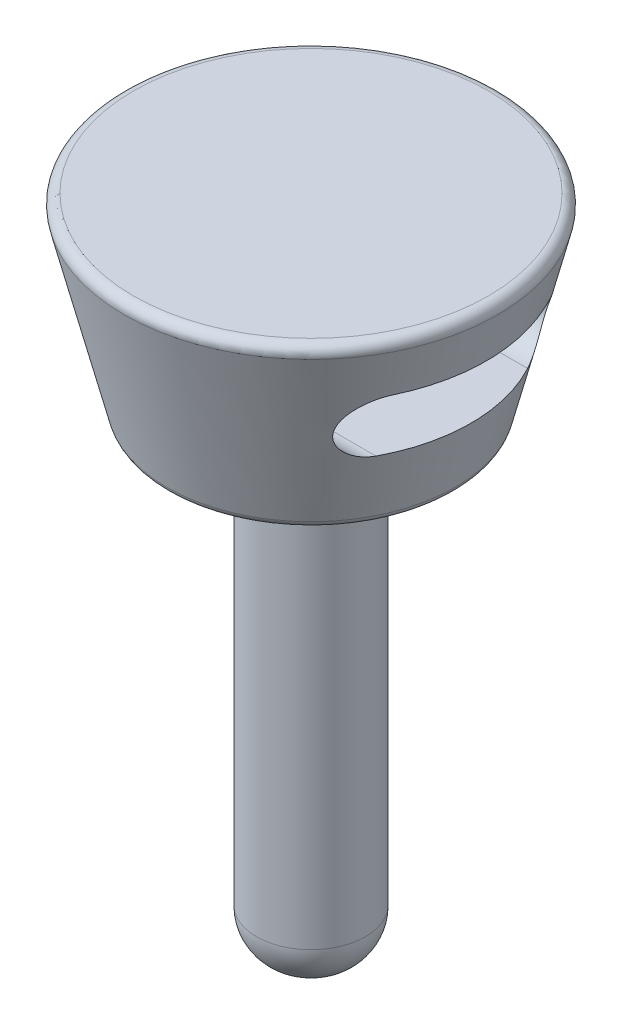
ISO-10303-21;
HEADER;
FILE_DESCRIPTION(('STEP AP214'),'2;1');
FILE_NAME('part.step','',(''),(''),'','','');
FILE_SCHEMA(('AUTOMOTIVE_DESIGN { 1 0 10303 214 1 1 1 1 }'));
ENDSEC;
DATA;
#1=APPLICATION_CONTEXT('core data for automotive mechanical design processes');
#2=APPLICATION_PROTOCOL_DEFINITION('international standard','automotive_design',2000,#1);
#3=PRODUCT_CONTEXT('',#1,'mechanical');
#4=PRODUCT('Part','Part','',(#3));
#5=PRODUCT_RELATED_PRODUCT_CATEGORY('part','',(#4));
#6=PRODUCT_DEFINITION_FORMATION('','',#4);
#7=PRODUCT_DEFINITION_CONTEXT('part definition',#1,'design');
#8=PRODUCT_DEFINITION('design','',#6,#7);
#9=PRODUCT_DEFINITION_SHAPE('','',#8);
#10=(LENGTH_UNIT() NAMED_UNIT(*) SI_UNIT(.MILLI.,.METRE.));
#11=(NAMED_UNIT(*) PLANE_ANGLE_UNIT() SI_UNIT($,.RADIAN.));
#12=(NAMED_UNIT(*) SI_UNIT($,.STERADIAN.) SOLID_ANGLE_UNIT());
#13=UNCERTAINTY_MEASURE_WITH_UNIT(LENGTH_MEASURE(1.E-05),#10,'distance_accuracy_value','');
#14=(GEOMETRIC_REPRESENTATION_CONTEXT(3) GLOBAL_UNCERTAINTY_ASSIGNED_CONTEXT((#13)) GLOBAL_UNIT_ASSIGNED_CONTEXT((#10,
#11,#12)) REPRESENTATION_CONTEXT('',''));
#15=CARTESIAN_POINT('',(0.,0.,0.));
#16=DIRECTION('',(0.,0.,1.));
#17=DIRECTION('',(1.,0.,0.));
#18=AXIS2_PLACEMENT_3D('',#15,#16,#17);
#19=CARTESIAN_POINT('',(0.,-14.,0.));
#20=DIRECTION('',(0.,-1.,0.));
#21=DIRECTION('',(0.,0.,-1.));
#22=AXIS2_PLACEMENT_3D('',#19,#20,#21);
#23=PLANE('',#22);
#24=CARTESIAN_POINT('',(0.,-14.,0.));
#25=DIRECTION('',(0.,1.,0.));
#26=DIRECTION('',(0.,0.,-1.));
#27=AXIS2_PLACEMENT_3D('',#24,#25,#26);
#28=CIRCLE('',#27,0.15);
#29=CARTESIAN_POINT('',(0.,-14.,-0.15));
#30=VERTEX_POINT('',#29);
#31=CARTESIAN_POINT('',(0.,-14.,0.15));
#32=VERTEX_POINT('',#31);
#33=EDGE_CURVE('E63',#30,#32,#28,.T.);
#34=ORIENTED_EDGE('',*,*,#33,.F.);
#35=CARTESIAN_POINT('',(0.,-14.,0.));
#36=DIRECTION('',(0.,1.,0.));
#37=DIRECTION('',(0.,0.,1.));
#38=AXIS2_PLACEMENT_3D('',#35,#36,#37);
#39=CIRCLE('',#38,0.15);
#40=EDGE_CURVE('E61',#32,#30,#39,.T.);
#41=ORIENTED_EDGE('',*,*,#40,.F.);
#42=EDGE_LOOP('',(#34,#41));
#43=FACE_BOUND('',#42,.T.);
#44=ADVANCED_FACE('F15',(#43),#23,.T.);
#45=CARTESIAN_POINT('',(0.,-13.,-0.15));
#46=DIRECTION('',(1.,0.,0.));
#47=DIRECTION('',(0.,0.,-1.));
#48=AXIS2_PLACEMENT_3D('',#45,#46,#47);
#49=CIRCLE('',#48,1.);
#50=TRIMMED_CURVE('',#49,(PARAMETER_VALUE(-1.72136459957158)),
(PARAMETER_VALUE(1.72136459957158)),.T.,.PARAMETER.);
#51=CARTESIAN_POINT('',(0.,-13.,0.));
#52=DIRECTION('',(0.,-1.,0.));
#53=AXIS1_PLACEMENT('',#51,#52);
#54=SURFACE_OF_REVOLUTION('',#50,#53);
#55=ORIENTED_EDGE('',*,*,#40,.T.);
#56=ORIENTED_EDGE('',*,*,#33,.T.);
#57=EDGE_LOOP('',(#55,#56));
#58=FACE_BOUND('',#57,.T.);
#59=CARTESIAN_POINT('',(0.,-13.,0.));
#60=DIRECTION('',(0.,1.,0.));
#61=DIRECTION('',(0.,0.,1.));
#62=AXIS2_PLACEMENT_3D('',#59,#60,#61);
#63=CIRCLE('',#62,1.15);
#64=CARTESIAN_POINT('',(0.,-13.,1.15));
#65=VERTEX_POINT('',#64);
#66=EDGE_CURVE('E69',#65,#65,#63,.T.);
#67=ORIENTED_EDGE('',*,*,#66,.F.);
#68=EDGE_LOOP('',(#67));
#69=FACE_BOUND('',#68,.T.);
#70=ADVANCED_FACE('F65',(#58,#69),#54,.F.);
#71=CARTESIAN_POINT('',(0.,-14.,0.));
#72=DIRECTION('',(0.,1.,0.));
#73=DIRECTION('',(0.,0.,1.));
#74=AXIS2_PLACEMENT_3D('',#71,#72,#73);
#75=CYLINDRICAL_SURFACE('',#74,1.15);
#76=CARTESIAN_POINT('',(0.,-4.,0.));
#77=DIRECTION('',(0.,1.,0.));
#78=DIRECTION('',(0.,0.,1.));
#79=AXIS2_PLACEMENT_3D('',#76,#77,#78);
#80=CIRCLE('',#79,1.15);
#81=CARTESIAN_POINT('',(0.,-4.,1.15));
#82=VERTEX_POINT('',#81);
#83=EDGE_CURVE('E91',#82,#82,#80,.F.);
#84=ORIENTED_EDGE('',*,*,#83,.T.);
#85=EDGE_LOOP('',(#84));
#86=FACE_BOUND('',#85,.T.);
#87=ORIENTED_EDGE('',*,*,#66,.T.);
#88=EDGE_LOOP('',(#87));
#89=FACE_BOUND('',#88,.T.);
#90=ADVANCED_FACE('F101',(#86,#89),#75,.T.);
#91=CARTESIAN_POINT('',(-3.,-4.,0.));
#92=DIRECTION('',(0.,1.,0.));
#93=DIRECTION('',(0.,0.,1.));
#94=AXIS2_PLACEMENT_3D('',#91,#92,#93);
#95=PLANE('',#94);
#96=ORIENTED_EDGE('',*,*,#83,.F.);
#97=EDGE_LOOP('',(#96));
#98=FACE_BOUND('',#97,.T.);
#99=CARTESIAN_POINT('',(0.,-4.,0.));
#100=DIRECTION('',(0.,1.,0.));
#101=DIRECTION('',(0.,0.,-1.));
#102=AXIS2_PLACEMENT_3D('',#99,#100,#101);
#103=CIRCLE('',#102,2.84384471871912);
#104=CARTESIAN_POINT('',(0.,-4.,-2.84384471871912));
#105=VERTEX_POINT('',#104);
#106=CARTESIAN_POINT('',(0.,-4.,2.84384471871912));
#107=VERTEX_POINT('',#106);
#108=EDGE_CURVE('E211',#105,#107,#103,.T.);
#109=ORIENTED_EDGE('',*,*,#108,.F.);
#110=CARTESIAN_POINT('',(0.,-4.,0.));
#111=DIRECTION('',(0.,1.,0.));
#112=DIRECTION('',(0.,0.,1.));
#113=AXIS2_PLACEMENT_3D('',#110,#111,#112);
#114=CIRCLE('',#113,2.84384471871912);
#115=EDGE_CURVE('E210',#107,#105,#114,.T.);
#116=ORIENTED_EDGE('',*,*,#115,.F.);
#117=EDGE_LOOP('',(#109,#116));
#118=FACE_BOUND('',#117,.T.);
#119=ADVANCED_FACE('F191',(#98,#118),#95,.F.);
#120=CARTESIAN_POINT('',(-4.,-1.86258614224946,-1.6));
#121=DIRECTION('',(1.,0.,0.));
#122=DIRECTION('',(0.,0.,-1.));
#123=AXIS2_PLACEMENT_3D('',#120,#121,#122);
#124=CYLINDRICAL_SURFACE('',#123,0.65);
#125=CARTESIAN_POINT('',(-2.96811669747267,-2.51258613400775,-1.59989970502933));
#126=CARTESIAN_POINT('',(-2.94656784911217,-2.51258707770298,-1.63995761628789));
#127=CARTESIAN_POINT('',(-2.92493537934197,-2.50889429176,-1.68001692264612));
#128=CARTESIAN_POINT('',(-2.88216932879334,-2.49402543937922,-1.75948598220322));
#129=CARTESIAN_POINT('',(-2.8610422841815,-2.48277988812432,-1.79888619035241));
#130=CARTESIAN_POINT('',(-2.82033350761219,-2.45266785909596,-1.87570133933229));
#131=CARTESIAN_POINT('',(-2.80075605328271,-2.43378110891764,-1.91311069725436));
#132=CARTESIAN_POINT('',(-2.76462923968333,-2.38837409514771,-1.98447697163249));
#133=CARTESIAN_POINT('',(-2.74806704324196,-2.36188749136257,-2.01844823707615));
#134=CARTESIAN_POINT('',(-2.72433919548095,-2.31132675937436,-2.0711677665883));
#135=CARTESIAN_POINT('',(-2.71586951234719,-2.28927121771197,-2.0912729752963));
#136=CARTESIAN_POINT('',(-2.70175778065077,-2.24202637229727,-2.12861034908388));
#137=CARTESIAN_POINT('',(-2.69611370716924,-2.21683932888098,-2.14584456567789));
#138=CARTESIAN_POINT('',(-2.68824031464957,-2.16369359585609,-2.17687644138903));
#139=CARTESIAN_POINT('',(-2.68603324654362,-2.1357180833169,-2.19065122720954));
#140=CARTESIAN_POINT('',(-2.68550168432519,-2.07804679084415,-2.21403847676503));
#141=CARTESIAN_POINT('',(-2.68717511428707,-2.04835193898139,-2.22365316273719));
#142=CARTESIAN_POINT('',(-2.69388939729819,-1.99241309037668,-2.23746459466603));
#143=CARTESIAN_POINT('',(-2.69844536027528,-1.96624416548572,-2.24221737944892));
#144=CARTESIAN_POINT('',(-2.71017844230291,-1.91411620439402,-2.24848655978275));
#145=CARTESIAN_POINT('',(-2.71735640748731,-1.88815723871541,-2.25000190951408));
#146=CARTESIAN_POINT('',(-2.73772265480352,-1.82534500227486,-2.24999752386016));
#147=CARTESIAN_POINT('',(-2.75216024375228,-1.78889335842613,-2.24678853734698));
#148=CARTESIAN_POINT('',(-2.78447638224761,-1.71848972131891,-2.23483851552229));
#149=CARTESIAN_POINT('',(-2.80236455408856,-1.68454509401326,-2.22608185020477));
#150=CARTESIAN_POINT('',(-2.84466336095401,-1.61243023720294,-2.20139735632142));
#151=CARTESIAN_POINT('',(-2.8696404507648,-1.57499432662291,-2.18430925179669));
#152=CARTESIAN_POINT('',(-2.92144714013446,-1.5049321040507,-2.14425523113983));
#153=CARTESIAN_POINT('',(-2.94827702930493,-1.47230654647624,-2.12128839457593));
#154=CARTESIAN_POINT('',(-3.00303137479889,-1.4116762526099,-2.06987279693198));
#155=CARTESIAN_POINT('',(-3.03096572025699,-1.38373987650435,-2.0413541863364));
#156=CARTESIAN_POINT('',(-3.0866468442486,-1.3334057903227,-1.97954918100603));
#157=CARTESIAN_POINT('',(-3.11439337111815,-1.31101446481789,-1.94625735936554));
#158=CARTESIAN_POINT('',(-3.17188373084525,-1.27022973043227,-1.87135913300566));
#159=CARTESIAN_POINT('',(-3.20149424997331,-1.25258394934567,-1.82923745763777));
#160=CARTESIAN_POINT('',(-3.25793615899892,-1.22632433763557,-1.74066275634528));
#161=CARTESIAN_POINT('',(-3.28477872921647,-1.21767277767835,-1.69422872124789));
#162=CARTESIAN_POINT('',(-3.31748364996796,-1.2131437593423,-1.63104554068258));
#163=CARTESIAN_POINT('',(-3.32522464705411,-1.21258198315924,-1.61552978964285));
#164=CARTESIAN_POINT('',(-3.33272317675399,-1.21258614985831,-1.59990054394578));
#165=B_SPLINE_CURVE_WITH_KNOTS('',3,(#125,#126,#127,#128,#129,#130,#131,#132,#133,#134,#135,
#136,#137,#138,#139,#140,#141,#142,#143,#144,#145,#146,#147,#148,#149,#150,#151,#152,#153,#154,
#155,#156,#157,#158,#159,#160,#161,#162,#163,#164),.UNSPECIFIED.,.F.,.F.,(4,2,2,2,2,2,2,2,2,2,2,
2,2,2,2,2,2,2,2,4),(0.,0.136378263020435,0.274028700954434,0.412046751114325,0.549462712347746,
0.642172161372687,0.734815076507286,0.828055298265947,0.921245651397994,1.00186043847749,
1.08250126338767,1.19973445923265,1.31729942519981,1.4609581284389,1.60463933806255,
1.75026110818489,1.89604977568966,2.05847224335431,2.22021059103756,2.27221861801425),.UNSPECIFIED.);
#166=CARTESIAN_POINT('',(-2.96811669960322,-2.51258613211799,-1.59989970617814));
#167=VERTEX_POINT('',#166);
#168=CARTESIAN_POINT('',(-3.33272215629659,-1.21258627021712,-1.59990007514877));
#169=VERTEX_POINT('',#168);
#170=EDGE_CURVE('E34',#167,#169,#165,.T.);
#171=ORIENTED_EDGE('',*,*,#170,.F.);
#172=DIRECTION('',(1.,0.,0.));
#173=VECTOR('',#172,1.);
#174=CARTESIAN_POINT('',(-4.,-2.51258614224946,-1.6));
#175=LINE('',#174,#173);
#176=CARTESIAN_POINT('',(2.96811671891956,-2.51258613465724,-1.59989972993306));
#177=VERTEX_POINT('',#176);
#178=EDGE_CURVE('E135',#167,#177,#175,.T.);
#179=ORIENTED_EDGE('',*,*,#178,.T.);
#180=CARTESIAN_POINT('',(3.33272271490899,-1.21258555368501,-1.59990043039473));
#181=CARTESIAN_POINT('',(3.31274304554227,-1.21259401560019,-1.64157371767493));
#182=CARTESIAN_POINT('',(3.29111238364842,-1.21657339898622,-1.68227573173086));
#183=CARTESIAN_POINT('',(3.24555178900161,-1.23151199884438,-1.76072451447666));
#184=CARTESIAN_POINT('',(3.22163610619978,-1.24243008482295,-1.79848723566193));
#185=CARTESIAN_POINT('',(3.17235225639973,-1.27024992166177,-1.87040772550609));
#186=CARTESIAN_POINT('',(3.14699030792987,-1.28712746738687,-1.90457936187191));
#187=CARTESIAN_POINT('',(3.09542394211604,-1.32623955997876,-1.96913354282518));
#188=CARTESIAN_POINT('',(3.06921770668299,-1.34848644475212,-1.99950711241617));
#189=CARTESIAN_POINT('',(3.01280491373156,-1.40155902949869,-2.06023715384329));
#190=CARTESIAN_POINT('',(2.98259054123298,-1.43317226016942,-2.08990153956267));
#191=CARTESIAN_POINT('',(2.92337781246381,-1.50238439519094,-2.1428167970563));
#192=CARTESIAN_POINT('',(2.89437883142812,-1.5399801753611,-2.16607099910509));
#193=CARTESIAN_POINT('',(2.84644184314249,-1.6102926375753,-2.19995900746476));
#194=CARTESIAN_POINT('',(2.82684657864637,-1.64174148855406,-2.21230194681899));
#195=CARTESIAN_POINT('',(2.79019957831243,-1.70745323780948,-2.23214207360822));
#196=CARTESIAN_POINT('',(2.77313872591363,-1.74170532689624,-2.23965696934821));
#197=CARTESIAN_POINT('',(2.75192317561622,-1.79100737392683,-2.24619961646506));
#198=CARTESIAN_POINT('',(2.74621700888476,-1.80510287823043,-2.24761049151875));
#199=CARTESIAN_POINT('',(2.73544006670038,-1.83360875510523,-2.24951115130758));
#200=CARTESIAN_POINT('',(2.73036977233642,-1.84801935650813,-2.25000024251632));
#201=CARTESIAN_POINT('',(2.71682730492675,-1.8897958203272,-2.25000071173129));
#202=CARTESIAN_POINT('',(2.70925536963331,-1.91747576422385,-2.24828382794491));
#203=CARTESIAN_POINT('',(2.69711630371722,-1.97303867350179,-2.24115867654851));
#204=CARTESIAN_POINT('',(2.69255016085872,-2.00092170258057,-2.23574919666515));
#205=CARTESIAN_POINT('',(2.68670209781596,-2.05613242614479,-2.22117341163728));
#206=CARTESIAN_POINT('',(2.68542873171841,-2.0834584916068,-2.21199739307919));
#207=CARTESIAN_POINT('',(2.68617996262003,-2.13660514383656,-2.19011847104622));
#208=CARTESIAN_POINT('',(2.68820463990094,-2.16242569394087,-2.17741548172327));
#209=CARTESIAN_POINT('',(2.69513205202708,-2.21108650957961,-2.14937467582747));
#210=CARTESIAN_POINT('',(2.69994427078636,-2.23399405089028,-2.13413000698959));
#211=CARTESIAN_POINT('',(2.71193303252666,-2.27731782399297,-2.10123685798097));
#212=CARTESIAN_POINT('',(2.71911043247448,-2.29773314911034,-2.08358750789306));
#213=CARTESIAN_POINT('',(2.73630334139913,-2.33808777420288,-2.04416722745339));
#214=CARTESIAN_POINT('',(2.74655293226929,-2.35769066596017,-2.0221556771441));
#215=CARTESIAN_POINT('',(2.76879271978816,-2.39340639745561,-1.97626673582145));
#216=CARTESIAN_POINT('',(2.7807840394791,-2.4095169685616,-1.95238814558861));
#217=CARTESIAN_POINT('',(2.80854136074579,-2.44113402404849,-1.89825054548166));
#218=CARTESIAN_POINT('',(2.82458060209151,-2.45586142535037,-1.86767688674353));
#219=CARTESIAN_POINT('',(2.85773657779529,-2.48028121853692,-1.80513469366742));
#220=CARTESIAN_POINT('',(2.87485373948644,-2.48997159926529,-1.77316560768409));
#221=CARTESIAN_POINT('',(2.90471985905002,-2.50230907238473,-1.71756387969426));
#222=CARTESIAN_POINT('',(2.91733937667032,-2.50617176874532,-1.69412275914243));
#223=CARTESIAN_POINT('',(2.94267973403828,-2.51130816761417,-1.64708964131617));
#224=CARTESIAN_POINT('',(2.95540023583153,-2.51258840850755,-1.62349817716351));
#225=CARTESIAN_POINT('',(2.96811669224597,-2.51258613451393,-1.59989971555422));
#226=B_SPLINE_CURVE_WITH_KNOTS('',3,(#180,#181,#182,#183,#184,#185,#186,#187,#188,#189,#190,
#191,#192,#193,#194,#195,#196,#197,#198,#199,#200,#201,#202,#203,#204,#205,#206,#207,#208,#209,
#210,#211,#212,#213,#214,#215,#216,#217,#218,#219,#220,#221,#222,#223,#224,#225),.UNSPECIFIED.,
.F.,.F.,(4,2,2,2,2,2,2,2,2,2,2,2,2,2,2,2,2,2,2,2,2,2,4),(0.,0.138206955013846,0.275602207275777,
0.412445710815908,0.549606704391823,0.707433534861964,0.865178214557442,0.981963928255333,
1.09831881214112,1.14409831168685,1.18991224081843,1.27577092921793,1.36165781845128,
1.44776760442276,1.53387948652973,1.61734052147815,1.70083182984597,1.79411143622435,
1.88745145719659,1.99964198649964,2.11187727633203,2.19246118332835,2.27284080672533),.UNSPECIFIED.);
#227=CARTESIAN_POINT('',(3.33272185404635,-1.21258629926379,-1.59990001728207));
#228=VERTEX_POINT('',#227);
#229=EDGE_CURVE('E187',#228,#177,#226,.T.);
#230=ORIENTED_EDGE('',*,*,#229,.F.);
#231=DIRECTION('',(1.,0.,0.));
#232=VECTOR('',#231,1.);
#233=CARTESIAN_POINT('',(-4.,-1.21258614224946,-1.6));
#234=LINE('',#233,#232);
#235=EDGE_CURVE('E133',#228,#169,#234,.F.);
#236=ORIENTED_EDGE('',*,*,#235,.T.);
#237=EDGE_LOOP('',(#171,#179,#230,#236));
#238=FACE_BOUND('',#237,.T.);
#239=ADVANCED_FACE('F188',(#238),#124,.F.);
#240=CARTESIAN_POINT('',(-4.,-1.86258614224946,1.6));
#241=DIRECTION('',(1.,0.,0.));
#242=DIRECTION('',(0.,0.,-1.));
#243=AXIS2_PLACEMENT_3D('',#240,#241,#242);
#244=CYLINDRICAL_SURFACE('',#243,0.65);
#245=CARTESIAN_POINT('',(-3.33272283803224,-1.21258568008095,1.59990040194267));
#246=CARTESIAN_POINT('',(-3.31274311074131,-1.21259405669112,1.6415736681288));
#247=CARTESIAN_POINT('',(-3.29111242536421,-1.21657340329638,1.68227567521231));
#248=CARTESIAN_POINT('',(-3.24555181249067,-1.23151197324829,1.76072445877642));
#249=CARTESIAN_POINT('',(-3.22163613462986,-1.24243006625224,1.79848718752281));
#250=CARTESIAN_POINT('',(-3.17235228569293,-1.2702499076391,1.870407689393));
#251=CARTESIAN_POINT('',(-3.14699033315779,-1.28712745101176,1.90457933018877));
#252=CARTESIAN_POINT('',(-3.09542396127863,-1.32623954267822,1.96913351893627));
#253=CARTESIAN_POINT('',(-3.06921772386645,-1.3484864287702,1.99950709197665));
#254=CARTESIAN_POINT('',(-3.01280492864382,-1.40155901525567,2.06023714002394));
#255=CARTESIAN_POINT('',(-2.98259055590541,-1.43317224606259,2.08990152937483));
#256=CARTESIAN_POINT('',(-2.92337782498499,-1.50238437750984,2.14281678294297));
#257=CARTESIAN_POINT('',(-2.89437884192362,-1.53998015338652,2.16607097806101));
#258=CARTESIAN_POINT('',(-2.84644239170468,-1.61029183783373,2.19995862975803));
#259=CARTESIAN_POINT('',(-2.82684762236221,-1.64173983499865,2.21230131927558));
#260=CARTESIAN_POINT('',(-2.79020141308556,-1.7074497314722,2.23214114228408));
#261=CARTESIAN_POINT('',(-2.77314085863238,-1.74170082380611,2.23965598075698));
#262=CARTESIAN_POINT('',(-2.75192250459108,-1.79100875473357,2.24619995370687));
#263=CARTESIAN_POINT('',(-2.74621358710441,-1.80511132294249,2.24761148859302));
#264=CARTESIAN_POINT('',(-2.735431668607,-1.83363157648151,2.24951223785358));
#265=CARTESIAN_POINT('',(-2.73035914911432,-1.84804949084132,2.25000075772932));
#266=CARTESIAN_POINT('',(-2.71681610002471,-1.8898334743255,2.24999858058928));
#267=CARTESIAN_POINT('',(-2.70924569780446,-1.91751345786129,2.24828048518682));
#268=CARTESIAN_POINT('',(-2.69710958795691,-1.97307599645531,2.24115239793821));
#269=CARTESIAN_POINT('',(-2.69254486520577,-2.00095861488851,2.23574119714751));
#270=CARTESIAN_POINT('',(-2.68669970598516,-2.05616812896735,2.22116223527264));
#271=CARTESIAN_POINT('',(-2.68542781971104,-2.08349339544175,2.21198476603542));
#272=CARTESIAN_POINT('',(-2.68618183764062,-2.13663814910111,2.19010313878669));
#273=CARTESIAN_POINT('',(-2.68820782431896,-2.16245759861123,2.1773988925826));
#274=CARTESIAN_POINT('',(-2.69513764535263,-2.21111652798454,2.14935563268286));
#275=CARTESIAN_POINT('',(-2.69995102550604,-2.23402324872504,2.13410970159407));
#276=CARTESIAN_POINT('',(-2.71194193750515,-2.27734520134622,2.10121420419009));
#277=CARTESIAN_POINT('',(-2.7191203257422,-2.29775952703204,2.08356376854142));
#278=CARTESIAN_POINT('',(-2.73631539030797,-2.33811252129046,2.04414078441097));
#279=CARTESIAN_POINT('',(-2.74656619182776,-2.35771467498509,2.022127568984));
#280=CARTESIAN_POINT('',(-2.76880828212627,-2.39342866663206,1.97623537572088));
#281=CARTESIAN_POINT('',(-2.78080069431904,-2.40953823486763,1.95235519823892));
#282=CARTESIAN_POINT('',(-2.80856034946729,-2.44115288951488,1.8982140704527));
#283=CARTESIAN_POINT('',(-2.82460081191757,-2.45587881549,1.86763848235569));
#284=CARTESIAN_POINT('',(-2.85775904864766,-2.48029525925747,1.80509258908053));
#285=CARTESIAN_POINT('',(-2.87487724947819,-2.48998376910049,1.77312173323441));
#286=CARTESIAN_POINT('',(-2.9047404219506,-2.50231579926289,1.71752567381909));
#287=CARTESIAN_POINT('',(-2.91735589651991,-2.50617596741711,1.69409208740285));
#288=CARTESIAN_POINT('',(-2.94268804741059,-2.51130900511934,1.64707421675157));
#289=CARTESIAN_POINT('',(-2.95540438616147,-2.51258840795037,1.62349046505021));
#290=CARTESIAN_POINT('',(-2.96811669224597,-2.51258613451393,1.59989971555422));
#291=B_SPLINE_CURVE_WITH_KNOTS('',3,(#245,#246,#247,#248,#249,#250,#251,#252,#253,#254,#255,
#256,#257,#258,#259,#260,#261,#262,#263,#264,#265,#266,#267,#268,#269,#270,#271,#272,#273,#274,
#275,#276,#277,#278,#279,#280,#281,#282,#283,#284,#285,#286,#287,#288,#289,#290),.UNSPECIFIED.,
.F.,.F.,(4,2,2,2,2,2,2,2,2,2,2,2,2,2,2,2,2,2,2,2,2,2,4),(0.,0.138206960171636,0.275602225546509,
0.412445744113066,0.549606749713162,0.707433585328715,0.865178254825439,0.981960941175704,
1.09831287283737,1.1441151310839,1.1899518383469,1.27580966677458,1.36169561440283,
1.4478043512557,1.53391524158614,1.61737694036531,1.70086889467755,1.79415181720907,
1.88749518073736,1.99969023257358,2.1119299719233,2.19248753136022,2.27284089974209),.UNSPECIFIED.);
#292=CARTESIAN_POINT('',(-3.33272215668301,-1.21258627018614,1.59990007497526));
#293=VERTEX_POINT('',#292);
#294=CARTESIAN_POINT('',(-2.96811671891956,-2.51258613465724,1.59989972993306));
#295=VERTEX_POINT('',#294);
#296=EDGE_CURVE('E141',#293,#295,#291,.T.);
#297=ORIENTED_EDGE('',*,*,#296,.F.);
#298=DIRECTION('',(1.,0.,0.));
#299=VECTOR('',#298,1.);
#300=CARTESIAN_POINT('',(-4.,-1.21258614224946,1.6));
#301=LINE('',#300,#299);
#302=CARTESIAN_POINT('',(3.33272215629659,-1.21258627021712,1.59990007514877));
#303=VERTEX_POINT('',#302);
#304=EDGE_CURVE('E136',#293,#303,#301,.T.);
#305=ORIENTED_EDGE('',*,*,#304,.T.);
#306=CARTESIAN_POINT('',(2.9681166922464,-2.51258613451333,1.59989971555345));
#307=CARTESIAN_POINT('',(2.94656784330005,-2.51258707725447,1.63995762736029));
#308=CARTESIAN_POINT('',(2.92493537309373,-2.50889429041418,1.68001693431288));
#309=CARTESIAN_POINT('',(2.88216932274872,-2.4940254364397,1.75948599339318));
#310=CARTESIAN_POINT('',(2.86104227875015,-2.48277988479055,1.79888620051219));
#311=CARTESIAN_POINT('',(2.82033350315124,-2.45266785511113,1.87570134783637));
#312=CARTESIAN_POINT('',(2.80075604919698,-2.43378110459072,1.91311070510914));
#313=CARTESIAN_POINT('',(2.76462923612242,-2.38837408986917,1.98447697888237));
#314=CARTESIAN_POINT('',(2.74806703988206,-2.36188748533805,2.01844824431225));
#315=CARTESIAN_POINT('',(2.72433919270828,-2.31132675270088,2.0711677729021));
#316=CARTESIAN_POINT('',(2.71586950990173,-2.28927121118197,2.09127298088188));
#317=CARTESIAN_POINT('',(2.7017577790728,-2.24202636536113,2.12861035414195));
#318=CARTESIAN_POINT('',(2.6961137061856,-2.21683932133478,2.14584457088125));
#319=CARTESIAN_POINT('',(2.68824031291289,-2.16369358504989,2.17687644689694));
#320=CARTESIAN_POINT('',(2.68603324391492,-2.13571806951936,2.19065123238593));
#321=CARTESIAN_POINT('',(2.68550168666419,-2.07804677353142,2.2140384842058));
#322=CARTESIAN_POINT('',(2.68717512137097,-2.04835192164471,2.22365317396009));
#323=CARTESIAN_POINT('',(2.69388870686188,-1.99241880658067,2.23746317731696));
#324=CARTESIAN_POINT('',(2.69844333541825,-1.96625571088736,2.24221526120224));
#325=CARTESIAN_POINT('',(2.7101726909255,-1.91413920485558,2.24848452393726));
#326=CARTESIAN_POINT('',(2.71734826137861,-1.88818586477471,2.25000066028025));
#327=CARTESIAN_POINT('',(2.73770974496829,-1.82538012678568,2.24999958730964));
#328=CARTESIAN_POINT('',(2.75214533908524,-1.78892932425394,2.24679261064967));
#329=CARTESIAN_POINT('',(2.7844576923097,-1.71852691979464,2.23484687293303));
#330=CARTESIAN_POINT('',(2.80234407703506,-1.68458268473759,2.22609247812352));
#331=CARTESIAN_POINT('',(2.84463910379695,-1.6124683215333,2.20141312497729));
#332=CARTESIAN_POINT('',(2.86961424388919,-1.57503242134679,2.18432791408367));
#333=CARTESIAN_POINT('',(2.92141735154763,-1.50496973625074,2.14427986162086));
#334=CARTESIAN_POINT('',(2.94824560867064,-1.47234370540985,2.12131609998117));
#335=CARTESIAN_POINT('',(3.00299707410169,-1.4117118407953,2.06990682679653));
#336=CARTESIAN_POINT('',(3.03093017787296,-1.3837743714086,2.04139145644824));
#337=CARTESIAN_POINT('',(3.086609225954,-1.33343743218208,1.97959311671811));
#338=CARTESIAN_POINT('',(3.11435491910296,-1.31104434538123,1.94630472128472));
#339=CARTESIAN_POINT('',(3.17184539914959,-1.27025402510997,1.8714121150242));
#340=CARTESIAN_POINT('',(3.20145687603294,-1.25260465059662,1.82929241336322));
#341=CARTESIAN_POINT('',(3.25790127979196,-1.22633728316245,1.74072114400124));
#342=CARTESIAN_POINT('',(3.28474538148374,-1.21768157407,1.69428856361702));
#343=CARTESIAN_POINT('',(3.31746323173798,-1.21314523997053,1.63108648199215));
#344=CARTESIAN_POINT('',(3.3252147553272,-1.21258197738746,1.6155504187112));
#345=CARTESIAN_POINT('',(3.33272317676456,-1.21258614985831,1.59990054392376));
#346=B_SPLINE_CURVE_WITH_KNOTS('',3,(#306,#307,#308,#309,#310,#311,#312,#313,#314,#315,#316,
#317,#318,#319,#320,#321,#322,#323,#324,#325,#326,#327,#328,#329,#330,#331,#332,#333,#334,#335,
#336,#337,#338,#339,#340,#341,#342,#343,#344,#345),.UNSPECIFIED.,.F.,.F.,(4,2,2,2,2,2,2,2,2,2,2,
2,2,2,2,2,2,2,2,4),(0.,0.136378265379296,0.27402870017211,0.412046748741846,0.549462710827786,
0.642172158186429,0.734815073440667,0.828055307748985,0.921245646721941,1.0018426683421,
1.08246565152776,1.19969381754145,1.31725383467296,1.46090641393839,1.60458149048287,
1.75019737230787,1.89598012475451,2.05840310440496,2.22014215761112,2.27221877494328),.UNSPECIFIED.);
#347=CARTESIAN_POINT('',(2.96811671891972,-2.51258613465729,1.59989972993228));
#348=VERTEX_POINT('',#347);
#349=EDGE_CURVE('E146',#348,#303,#346,.T.);
#350=ORIENTED_EDGE('',*,*,#349,.F.);
#351=DIRECTION('',(1.,0.,0.));
#352=VECTOR('',#351,1.);
#353=CARTESIAN_POINT('',(-4.,-2.51258614224946,1.6));
#354=LINE('',#353,#352);
#355=EDGE_CURVE('E130',#348,#295,#354,.F.);
#356=ORIENTED_EDGE('',*,*,#355,.T.);
#357=EDGE_LOOP('',(#297,#305,#350,#356));
#358=FACE_BOUND('',#357,.T.);
#359=ADVANCED_FACE('F155',(#358),#244,.F.);
#360=CARTESIAN_POINT('',(0.,-3.8,0.));
#361=DIRECTION('',(0.,1.,0.));
#362=DIRECTION('',(0.,0.,1.));
#363=AXIS2_PLACEMENT_3D('',#360,#361,#362);
#364=TOROIDAL_SURFACE('',#363,2.84384471871912,0.2);
#365=ORIENTED_EDGE('',*,*,#108,.T.);
#366=ORIENTED_EDGE('',*,*,#115,.T.);
#367=EDGE_LOOP('',(#365,#366));
#368=FACE_BOUND('',#367,.T.);
#369=CARTESIAN_POINT('',(0.,-3.84850712498519,0.));
#370=DIRECTION('',(0.,1.,0.));
#371=DIRECTION('',(0.,0.,1.));
#372=AXIS2_PLACEMENT_3D('',#369,#370,#371);
#373=CIRCLE('',#372,3.03787321874438);
#374=CARTESIAN_POINT('',(0.,-3.84850712498519,3.03787321874438));
#375=VERTEX_POINT('',#374);
#376=EDGE_CURVE('E120',#375,#375,#373,.T.);
#377=ORIENTED_EDGE('',*,*,#376,.F.);
#378=EDGE_LOOP('',(#377));
#379=FACE_BOUND('',#378,.T.);
#380=ADVANCED_FACE('F234',(#368,#379),#364,.T.);
#381=CARTESIAN_POINT('',(-4.,-1.21258614224946,1.6));
#382=DIRECTION('',(0.,1.,0.));
#383=DIRECTION('',(0.,0.,1.));
#384=AXIS2_PLACEMENT_3D('',#381,#382,#383);
#385=PLANE('',#384);
#386=ORIENTED_EDGE('',*,*,#235,.F.);
#387=CARTESIAN_POINT('',(0.,-1.21258614223052,0.));
#388=DIRECTION('',(0.,1.,0.));
#389=DIRECTION('',(0.,0.,1.));
#390=AXIS2_PLACEMENT_3D('',#387,#388,#389);
#391=CIRCLE('',#390,3.69685346443305);
#392=EDGE_CURVE('E115',#303,#228,#391,.T.);
#393=ORIENTED_EDGE('',*,*,#392,.F.);
#394=ORIENTED_EDGE('',*,*,#304,.F.);
#395=CARTESIAN_POINT('',(0.,-1.21258614223052,0.));
#396=DIRECTION('',(0.,1.,0.));
#397=DIRECTION('',(0.,0.,1.));
#398=AXIS2_PLACEMENT_3D('',#395,#396,#397);
#399=CIRCLE('',#398,3.69685346443305);
#400=EDGE_CURVE('E123',#169,#293,#399,.T.);
#401=ORIENTED_EDGE('',*,*,#400,.F.);
#402=EDGE_LOOP('',(#386,#393,#394,#401));
#403=FACE_BOUND('',#402,.T.);
#404=ADVANCED_FACE('F243',(#403),#385,.F.);
#405=CARTESIAN_POINT('',(-4.,-2.51258614224946,1.6));
#406=DIRECTION('',(0.,-1.,0.));
#407=DIRECTION('',(0.,0.,-1.));
#408=AXIS2_PLACEMENT_3D('',#405,#406,#407);
#409=PLANE('',#408);
#410=ORIENTED_EDGE('',*,*,#355,.F.);
#411=CARTESIAN_POINT('',(0.,-2.51258614224525,0.));
#412=DIRECTION('',(0.,1.,0.));
#413=DIRECTION('',(0.,0.,1.));
#414=AXIS2_PLACEMENT_3D('',#411,#412,#413);
#415=CIRCLE('',#414,3.37185346442936);
#416=EDGE_CURVE('E106',#177,#348,#415,.F.);
#417=ORIENTED_EDGE('',*,*,#416,.F.);
#418=ORIENTED_EDGE('',*,*,#178,.F.);
#419=CARTESIAN_POINT('',(0.,-2.51258614224525,0.));
#420=DIRECTION('',(0.,1.,0.));
#421=DIRECTION('',(0.,0.,1.));
#422=AXIS2_PLACEMENT_3D('',#419,#420,#421);
#423=CIRCLE('',#422,3.37185346442936);
#424=EDGE_CURVE('E126',#295,#167,#423,.F.);
#425=ORIENTED_EDGE('',*,*,#424,.F.);
#426=EDGE_LOOP('',(#410,#417,#418,#425));
#427=FACE_BOUND('',#426,.T.);
#428=ADVANCED_FACE('F165',(#427),#409,.F.);
#429=CARTESIAN_POINT('',(0.,-0.248507125093056,0.));
#430=DIRECTION('',(0.,1.,0.));
#431=DIRECTION('',(0.,0.,1.));
#432=AXIS2_PLACEMENT_3D('',#429,#430,#431);
#433=CONICAL_SURFACE('',#432,3.93787321871741,0.244978663126864);
#434=CARTESIAN_POINT('',(0.,-0.248507125007267,0.));
#435=DIRECTION('',(0.,-1.,0.));
#436=DIRECTION('',(0.,0.,-1.));
#437=AXIS2_PLACEMENT_3D('',#434,#435,#436);
#438=CIRCLE('',#437,3.93787321874818);
#439=CARTESIAN_POINT('',(0.,-0.248507125007267,-3.93787321874818));
#440=VERTEX_POINT('',#439);
#441=EDGE_CURVE('E114',#440,#440,#438,.F.);
#442=ORIENTED_EDGE('',*,*,#441,.F.);
#443=EDGE_LOOP('',(#442));
#444=FACE_BOUND('',#443,.T.);
#445=ORIENTED_EDGE('',*,*,#229,.T.);
#446=ORIENTED_EDGE('',*,*,#416,.T.);
#447=ORIENTED_EDGE('',*,*,#349,.T.);
#448=ORIENTED_EDGE('',*,*,#392,.T.);
#449=EDGE_LOOP('',(#445,#446,#447,#448));
#450=FACE_BOUND('',#449,.T.);
#451=ORIENTED_EDGE('',*,*,#376,.T.);
#452=EDGE_LOOP('',(#451));
#453=FACE_BOUND('',#452,.T.);
#454=ORIENTED_EDGE('',*,*,#170,.T.);
#455=ORIENTED_EDGE('',*,*,#400,.T.);
#456=ORIENTED_EDGE('',*,*,#296,.T.);
#457=ORIENTED_EDGE('',*,*,#424,.T.);
#458=EDGE_LOOP('',(#454,#455,#456,#457));
#459=FACE_BOUND('',#458,.T.);
#460=ADVANCED_FACE('F159',(#444,#450,#453,#459),#433,.T.);
#461=CARTESIAN_POINT('',(0.,-0.2,0.));
#462=DIRECTION('',(0.,-1.,0.));
#463=DIRECTION('',(0.,0.,-1.));
#464=AXIS2_PLACEMENT_3D('',#461,#462,#463);
#465=TOROIDAL_SURFACE('',#464,3.74384471871912,0.2);
#466=ORIENTED_EDGE('',*,*,#441,.T.);
#467=EDGE_LOOP('',(#466));
#468=FACE_BOUND('',#467,.T.);
#469=CARTESIAN_POINT('',(0.,0.,0.));
#470=DIRECTION('',(0.,-1.,0.));
#471=DIRECTION('',(0.,0.,-1.));
#472=AXIS2_PLACEMENT_3D('',#469,#470,#471);
#473=CIRCLE('',#472,3.74384471871912);
#474=CARTESIAN_POINT('',(0.,0.,-3.74384471871912));
#475=VERTEX_POINT('',#474);
#476=CARTESIAN_POINT('',(0.,0.,3.74384471871912));
#477=VERTEX_POINT('',#476);
#478=EDGE_CURVE('E10',#475,#477,#473,.T.);
#479=ORIENTED_EDGE('',*,*,#478,.T.);
#480=CARTESIAN_POINT('',(0.,0.,0.));
#481=DIRECTION('',(0.,-1.,0.));
#482=DIRECTION('',(0.,0.,1.));
#483=AXIS2_PLACEMENT_3D('',#480,#481,#482);
#484=CIRCLE('',#483,3.74384471871912);
#485=EDGE_CURVE('E26',#477,#475,#484,.T.);
#486=ORIENTED_EDGE('',*,*,#485,.T.);
#487=EDGE_LOOP('',(#479,#486));
#488=FACE_BOUND('',#487,.T.);
#489=ADVANCED_FACE('F164',(#468,#488),#465,.T.);
#490=CARTESIAN_POINT('',(0.,0.,0.));
#491=DIRECTION('',(0.,-1.,0.));
#492=DIRECTION('',(0.,0.,-1.));
#493=AXIS2_PLACEMENT_3D('',#490,#491,#492);
#494=PLANE('',#493);
#495=ORIENTED_EDGE('',*,*,#485,.F.);
#496=ORIENTED_EDGE('',*,*,#478,.F.);
#497=EDGE_LOOP('',(#495,#496));
#498=FACE_BOUND('',#497,.T.);
#499=ADVANCED_FACE('F276',(#498),#494,.F.);
#500=CLOSED_SHELL('',(#44,#70,#90,#119,#239,#359,#380,#404,#428,#460,#489,#499));
#501=MANIFOLD_SOLID_BREP('B1',#500);
#502=ADVANCED_BREP_SHAPE_REPRESENTATION('',(#18,#501),#14);
#503=SHAPE_DEFINITION_REPRESENTATION(#9,#502);
ENDSEC;
END-ISO-10303-21;
